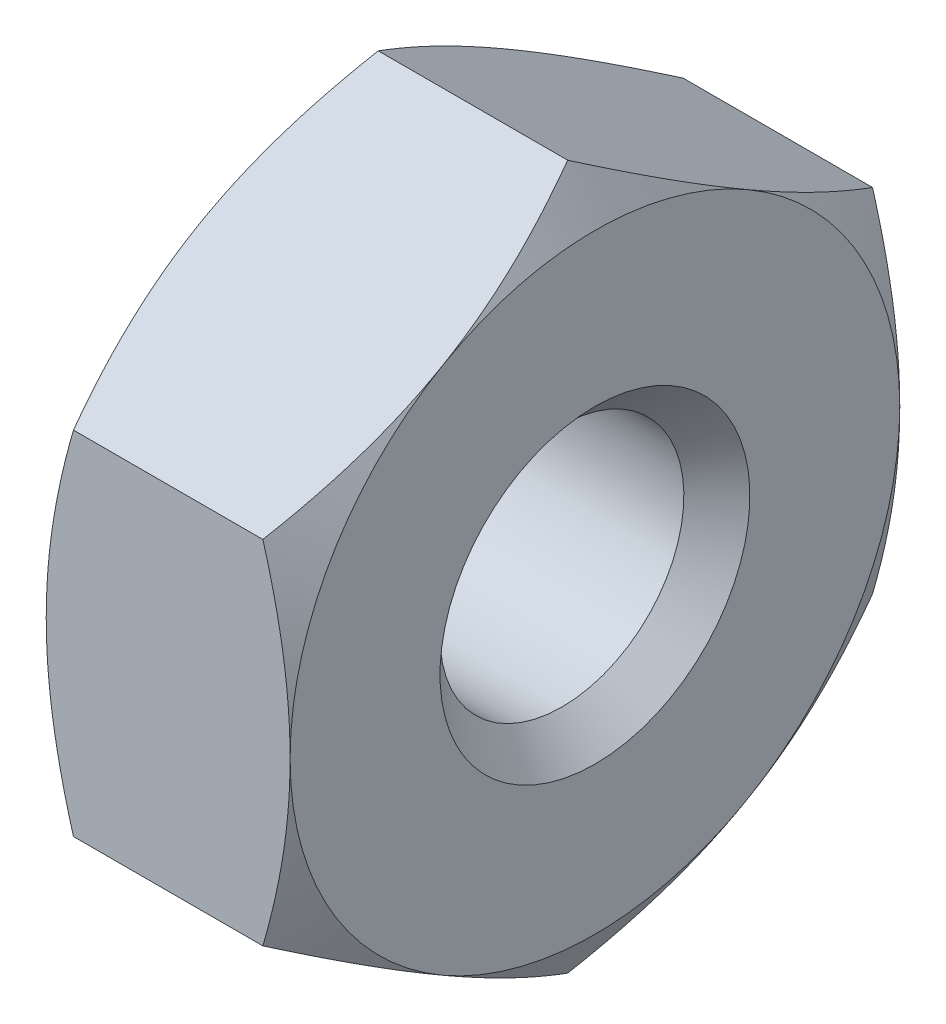
ISO-10303-21;
HEADER;
FILE_DESCRIPTION(('STEP AP214'),'2;1');
FILE_NAME('part.step','',(''),(''),'','','');
FILE_SCHEMA(('AUTOMOTIVE_DESIGN { 1 0 10303 214 1 1 1 1 }'));
ENDSEC;
DATA;
#1=APPLICATION_CONTEXT('core data for automotive mechanical design processes');
#2=APPLICATION_PROTOCOL_DEFINITION('international standard','automotive_design',2000,#1);
#3=PRODUCT_CONTEXT('',#1,'mechanical');
#4=PRODUCT('Part','Part','',(#3));
#5=PRODUCT_RELATED_PRODUCT_CATEGORY('part','',(#4));
#6=PRODUCT_DEFINITION_FORMATION('','',#4);
#7=PRODUCT_DEFINITION_CONTEXT('part definition',#1,'design');
#8=PRODUCT_DEFINITION('design','',#6,#7);
#9=PRODUCT_DEFINITION_SHAPE('','',#8);
#10=(LENGTH_UNIT() NAMED_UNIT(*) SI_UNIT(.MILLI.,.METRE.));
#11=(NAMED_UNIT(*) PLANE_ANGLE_UNIT() SI_UNIT($,.RADIAN.));
#12=(NAMED_UNIT(*) SI_UNIT($,.STERADIAN.) SOLID_ANGLE_UNIT());
#13=UNCERTAINTY_MEASURE_WITH_UNIT(LENGTH_MEASURE(1.E-05),#10,'distance_accuracy_value','');
#14=(GEOMETRIC_REPRESENTATION_CONTEXT(3) GLOBAL_UNCERTAINTY_ASSIGNED_CONTEXT((#13)) GLOBAL_UNIT_ASSIGNED_CONTEXT((#10,
#11,#12)) REPRESENTATION_CONTEXT('',''));
#15=CARTESIAN_POINT('',(0.,0.,0.));
#16=DIRECTION('',(0.,0.,1.));
#17=DIRECTION('',(1.,0.,0.));
#18=AXIS2_PLACEMENT_3D('',#15,#16,#17);
#19=CARTESIAN_POINT('',(0.,0.,0.));
#20=DIRECTION('',(1.,0.,0.));
#21=DIRECTION('',(0.,0.,-1.));
#22=AXIS2_PLACEMENT_3D('',#19,#20,#21);
#23=PLANE('',#22);
#24=CARTESIAN_POINT('',(0.,0.,0.));
#25=DIRECTION('',(-1.,0.,0.));
#26=DIRECTION('',(0.,0.,1.));
#27=AXIS2_PLACEMENT_3D('',#24,#25,#26);
#28=CIRCLE('',#27,2.);
#29=CARTESIAN_POINT('',(0.,0.,2.));
#30=VERTEX_POINT('',#29);
#31=CARTESIAN_POINT('',(0.,1.73205080756891,0.999999999999976));
#32=VERTEX_POINT('',#31);
#33=EDGE_CURVE('E11',#30,#32,#28,.T.);
#34=ORIENTED_EDGE('',*,*,#33,.T.);
#35=CARTESIAN_POINT('',(0.,1.73205080756891,-0.999999999999977));
#36=VERTEX_POINT('',#35);
#37=EDGE_CURVE('E42',#32,#36,#28,.T.);
#38=ORIENTED_EDGE('',*,*,#37,.T.);
#39=CARTESIAN_POINT('',(0.,0.,-2.));
#40=VERTEX_POINT('',#39);
#41=EDGE_CURVE('E142',#36,#40,#28,.T.);
#42=ORIENTED_EDGE('',*,*,#41,.T.);
#43=CARTESIAN_POINT('',(0.,-1.73205080756891,-0.999999999999976));
#44=VERTEX_POINT('',#43);
#45=EDGE_CURVE('E154',#40,#44,#28,.T.);
#46=ORIENTED_EDGE('',*,*,#45,.T.);
#47=CARTESIAN_POINT('',(0.,-1.73205080756891,0.999999999999977));
#48=VERTEX_POINT('',#47);
#49=EDGE_CURVE('E149',#44,#48,#28,.T.);
#50=ORIENTED_EDGE('',*,*,#49,.T.);
#51=EDGE_CURVE('E43',#48,#30,#28,.T.);
#52=ORIENTED_EDGE('',*,*,#51,.T.);
#53=EDGE_LOOP('',(#34,#38,#42,#46,#50,#52));
#54=FACE_BOUND('',#53,.T.);
#55=CARTESIAN_POINT('',(0.,-0.0165000000000002,0.));
#56=DIRECTION('',(-1.,0.,0.));
#57=DIRECTION('',(0.,-1.,0.));
#58=AXIS2_PLACEMENT_3D('',#55,#56,#57);
#59=CIRCLE('',#58,1.0165);
#60=CARTESIAN_POINT('',(0.,-1.033,0.));
#61=VERTEX_POINT('',#60);
#62=EDGE_CURVE('E476',#61,#61,#59,.T.);
#63=ORIENTED_EDGE('',*,*,#62,.F.);
#64=EDGE_LOOP('',(#63));
#65=FACE_BOUND('',#64,.T.);
#66=ADVANCED_FACE('F35',(#54,#65),#23,.F.);
#67=CARTESIAN_POINT('',(1.6,2.,0.));
#68=DIRECTION('',(-1.,0.,0.));
#69=DIRECTION('',(0.,0.,1.));
#70=AXIS2_PLACEMENT_3D('',#67,#68,#69);
#71=PLANE('',#70);
#72=CARTESIAN_POINT('',(1.6,0.,0.));
#73=DIRECTION('',(-1.,0.,0.));
#74=DIRECTION('',(0.,0.,1.));
#75=AXIS2_PLACEMENT_3D('',#72,#73,#74);
#76=CIRCLE('',#75,2.);
#77=CARTESIAN_POINT('',(1.6,0.,2.));
#78=VERTEX_POINT('',#77);
#79=CARTESIAN_POINT('',(1.6,1.73205080756891,0.999999999999976));
#80=VERTEX_POINT('',#79);
#81=EDGE_CURVE('E153',#78,#80,#76,.T.);
#82=ORIENTED_EDGE('',*,*,#81,.F.);
#83=CARTESIAN_POINT('',(1.6,-1.73205080756891,0.999999999999977));
#84=VERTEX_POINT('',#83);
#85=EDGE_CURVE('E157',#84,#78,#76,.T.);
#86=ORIENTED_EDGE('',*,*,#85,.F.);
#87=CARTESIAN_POINT('',(1.6,-1.73205080756891,-0.999999999999976));
#88=VERTEX_POINT('',#87);
#89=EDGE_CURVE('E166',#88,#84,#76,.T.);
#90=ORIENTED_EDGE('',*,*,#89,.F.);
#91=CARTESIAN_POINT('',(1.6,0.,-2.));
#92=VERTEX_POINT('',#91);
#93=EDGE_CURVE('E173',#92,#88,#76,.T.);
#94=ORIENTED_EDGE('',*,*,#93,.F.);
#95=CARTESIAN_POINT('',(1.6,1.73205080756891,-0.999999999999977));
#96=VERTEX_POINT('',#95);
#97=EDGE_CURVE('E163',#96,#92,#76,.T.);
#98=ORIENTED_EDGE('',*,*,#97,.F.);
#99=EDGE_CURVE('E156',#80,#96,#76,.T.);
#100=ORIENTED_EDGE('',*,*,#99,.F.);
#101=EDGE_LOOP('',(#82,#86,#90,#94,#98,#100));
#102=FACE_BOUND('',#101,.T.);
#103=CARTESIAN_POINT('',(1.6,-0.0165,0.));
#104=DIRECTION('',(-1.,0.,0.));
#105=DIRECTION('',(0.,-1.,0.));
#106=AXIS2_PLACEMENT_3D('',#103,#104,#105);
#107=CIRCLE('',#106,1.0165);
#108=CARTESIAN_POINT('',(1.6,-1.033,0.));
#109=VERTEX_POINT('',#108);
#110=EDGE_CURVE('E469',#109,#109,#107,.T.);
#111=ORIENTED_EDGE('',*,*,#110,.T.);
#112=EDGE_LOOP('',(#111));
#113=FACE_BOUND('',#112,.T.);
#114=ADVANCED_FACE('F196',(#102,#113),#71,.F.);
#115=CARTESIAN_POINT('',(0.23094010767585,0.,0.));
#116=DIRECTION('',(1.,0.,0.));
#117=DIRECTION('',(0.,0.,-1.));
#118=AXIS2_PLACEMENT_3D('',#115,#116,#117);
#119=CONICAL_SURFACE('',#118,2.4,1.0471975511966);
#120=CARTESIAN_POINT('',(0.960564620719933,-3.06969706647036,-2.));
#121=CARTESIAN_POINT('',(0.918447719225208,-2.9826070276099,-2.));
#122=CARTESIAN_POINT('',(0.876744016162863,-2.89531359514955,-2.));
#123=CARTESIAN_POINT('',(0.794396068040801,-2.7202116534341,-2.));
#124=CARTESIAN_POINT('',(0.753751996572019,-2.63240306263545,-2.));
#125=CARTESIAN_POINT('',(0.673544990993442,-2.45569454632309,-2.));
#126=CARTESIAN_POINT('',(0.633989435943704,-2.36679125959124,-2.));
#127=CARTESIAN_POINT('',(0.556540402154615,-2.18826628410374,-2.));
#128=CARTESIAN_POINT('',(0.518646842634758,-2.09864463051497,-2.));
#129=CARTESIAN_POINT('',(0.443829653550125,-1.91577344840977,-2.));
#130=CARTESIAN_POINT('',(0.406971478102181,-1.82249699059152,-2.));
#131=CARTESIAN_POINT('',(0.336122939262721,-1.6348410353351,-2.));
#132=CARTESIAN_POINT('',(0.302132902146455,-1.54046141378927,-2.));
#133=CARTESIAN_POINT('',(0.23793647872302,-1.35063624877528,-2.));
#134=CARTESIAN_POINT('',(0.207722147203833,-1.25519342016057,-2.));
#135=CARTESIAN_POINT('',(0.152067637871518,-1.06293935737291,-2.));
#136=CARTESIAN_POINT('',(0.126625921949113,-0.966128574914755,-2.));
#137=CARTESIAN_POINT('',(0.0818921981020604,-0.771614672106065,-2.));
#138=CARTESIAN_POINT('',(0.0625680611245456,-0.673919082405869,-2.));
#139=CARTESIAN_POINT('',(0.0311826829037339,-0.477348057700207,-2.));
#140=CARTESIAN_POINT('',(0.019120817656442,-0.378472724807819,-2.));
#141=CARTESIAN_POINT('',(0.00338395694954182,-0.181309994953057,-2.));
#142=CARTESIAN_POINT('',(-0.000396305644867935,-0.0830312460429947,-2.));
#143=CARTESIAN_POINT('',(0.000463238435134451,0.113485509919442,-2.));
#144=CARTESIAN_POINT('',(0.0051032754562111,0.211723515783711,-2.));
#145=CARTESIAN_POINT('',(0.0261043536527811,0.449358015625644,-2.));
#146=CARTESIAN_POINT('',(0.0466295476569,0.588388308666181,-2.));
#147=CARTESIAN_POINT('',(0.100865803906909,0.863858384666713,-2.));
#148=CARTESIAN_POINT('',(0.134590227817296,1.00029539521143,-2.));
#149=CARTESIAN_POINT('',(0.212402210305629,1.2733111237595,-2.));
#150=CARTESIAN_POINT('',(0.256698760305387,1.40982867525533,-2.));
#151=CARTESIAN_POINT('',(0.35218269853151,1.68033618831129,-2.));
#152=CARTESIAN_POINT('',(0.403368017200074,1.81432689526771,-2.));
#153=CARTESIAN_POINT('',(0.525435422837317,2.117419520614,-2.));
#154=CARTESIAN_POINT('',(0.59783250306695,2.28590501198163,-2.));
#155=CARTESIAN_POINT('',(0.747637620106175,2.62064677617018,-2.));
#156=CARTESIAN_POINT('',(0.825046777956453,2.78690254016494,-2.));
#157=CARTESIAN_POINT('',(0.983289343459741,3.11794960660753,-2.));
#158=CARTESIAN_POINT('',(1.06412572953733,3.28273947819276,-2.));
#159=CARTESIAN_POINT('',(1.22813169774068,3.61115513686861,-2.));
#160=CARTESIAN_POINT('',(1.31130135119586,3.77478088817925,-2.));
#161=CARTESIAN_POINT('',(1.47277008597423,4.0884514085166,-2.));
#162=CARTESIAN_POINT('',(1.55094370088272,4.23856092803469,-2.));
#163=CARTESIAN_POINT('',(1.70837218486806,4.53821671672572,-2.));
#164=CARTESIAN_POINT('',(1.78762708542198,4.68776296933911,-2.));
#165=CARTESIAN_POINT('',(1.94679238177092,4.98608322935775,-2.));
#166=CARTESIAN_POINT('',(2.02670095253288,5.13485821182457,-2.));
#167=CARTESIAN_POINT('',(2.18717495383285,5.43204425779157,-2.));
#168=CARTESIAN_POINT('',(2.26774035205521,5.5804553387338,-2.));
#169=CARTESIAN_POINT('',(2.3485529800385,5.72873071831092,-2.));
#170=B_SPLINE_CURVE_WITH_KNOTS('',3,(#120,#121,#122,#123,#124,#125,#126,#127,#128,#129,#130,
#131,#132,#133,#134,#135,#136,#137,#138,#139,#140,#141,#142,#143,#144,#145,#146,#147,#148,#149,
#150,#151,#152,#153,#154,#155,#156,#157,#158,#159,#160,#161,#162,#163,#164,#165,#166,#167,#168,
#169),.UNSPECIFIED.,.F.,.F.,(4,2,2,2,2,2,2,2,2,2,2,2,2,2,2,2,2,2,2,2,2,2,2,2,4),(0.,
0.290221855965844,0.580490961635766,0.872395030380332,1.16428489550747,1.46513250000125,
1.76601428247193,2.06625185869287,2.36639250807088,2.66492963544421,2.96344110762832,
3.25813564536262,3.55283824491541,3.97358015663303,4.39474909430442,4.82505701428419,
5.25523594641708,5.80524450910989,6.35537651886984,6.90599683350142,7.45663399931517,
7.96436452021779,8.47210985322803,8.97873847527003,9.48534232003251),.UNSPECIFIED.);
#171=CARTESIAN_POINT('',(0.178632794954096,-1.1547005383793,-2.));
#172=VERTEX_POINT('',#171);
#173=EDGE_CURVE('E278',#40,#172,#170,.F.);
#174=ORIENTED_EDGE('',*,*,#173,.T.);
#175=CARTESIAN_POINT('',(0.178699466620512,-1.15458506832546,-2.0002));
#176=CARTESIAN_POINT('',(0.149389536100693,-1.20532911262023,-1.91230873709994));
#177=CARTESIAN_POINT('',(0.12273285198048,-1.25651117447785,-1.82365880552641));
#178=CARTESIAN_POINT('',(0.0762024910207341,-1.35976164019324,-1.64482375300219));
#179=CARTESIAN_POINT('',(0.0563452763827919,-1.41183187919149,-1.55463545349495));
#180=CARTESIAN_POINT('',(0.0254334640232647,-1.51532701829187,-1.37537661423668));
#181=CARTESIAN_POINT('',(0.0141731515985431,-1.56673599086582,-1.28633366177368));
#182=CARTESIAN_POINT('',(0.000728662594653389,-1.66979593505377,-1.10782860221494));
#183=CARTESIAN_POINT('',(-0.00146664504652047,-1.72144653186535,-1.01836714429602));
#184=CARTESIAN_POINT('',(0.00309098933066007,-1.81796535054797,-0.851191646451181));
#185=CARTESIAN_POINT('',(0.0087248746870256,-1.86284799277606,-0.773452629734197));
#186=CARTESIAN_POINT('',(0.0265838952608381,-1.95232085557727,-0.618481085463851));
#187=CARTESIAN_POINT('',(0.0388151360234481,-1.99691076648956,-0.541249094258788));
#188=CARTESIAN_POINT('',(0.0693934368676162,-2.08656822922817,-0.38595781351779));
#189=CARTESIAN_POINT('',(0.0878701670657209,-2.13162442866768,-0.307918186892613));
#190=CARTESIAN_POINT('',(0.129805518212858,-2.221064675979,-0.153003134307861));
#191=CARTESIAN_POINT('',(0.153254280492314,-2.26544987045196,-0.076125722376878));
#192=CARTESIAN_POINT('',(0.178699466620497,-2.30951654681234,0.000199999999999941));
#193=B_SPLINE_CURVE_WITH_KNOTS('',3,(#175,#176,#177,#178,#179,#180,#181,#182,#183,#184,#185,
#186,#187,#188,#189,#190,#191,#192),.UNSPECIFIED.,.F.,.F.,(4,2,2,2,2,2,2,2,4),(0.,
0.317031824695613,0.63482587634657,0.944753967652646,1.25430138000373,1.52387047293094,
1.79368946861028,2.06949491027632,2.3447585082147),.UNSPECIFIED.);
#194=EDGE_CURVE('E245',#172,#44,#193,.T.);
#195=ORIENTED_EDGE('',*,*,#194,.T.);
#196=ORIENTED_EDGE('',*,*,#45,.F.);
#197=EDGE_LOOP('',(#174,#195,#196));
#198=FACE_BOUND('',#197,.T.);
#199=ADVANCED_FACE('F199',(#198),#119,.T.);
#200=ORIENTED_EDGE('',*,*,#49,.F.);
#201=CARTESIAN_POINT('',(0.17863279495408,-2.3094010767585,0.));
#202=VERTEX_POINT('',#201);
#203=EDGE_CURVE('E246',#44,#202,#193,.T.);
#204=ORIENTED_EDGE('',*,*,#203,.T.);
#205=CARTESIAN_POINT('',(0.178699466620497,-2.30951654681234,-0.0002));
#206=CARTESIAN_POINT('',(0.149389536100679,-2.25877250251757,0.0876912629000611));
#207=CARTESIAN_POINT('',(0.122732851980468,-2.20759044065996,0.176341194473594));
#208=CARTESIAN_POINT('',(0.0762024910207237,-2.10433997494457,0.355176246997806));
#209=CARTESIAN_POINT('',(0.0563452763827828,-2.05226973594631,0.445364546505042));
#210=CARTESIAN_POINT('',(0.0254334640232587,-1.94877459684593,0.624623385763314));
#211=CARTESIAN_POINT('',(0.0141731515985388,-1.89736562427198,0.713666338226313));
#212=CARTESIAN_POINT('',(0.000728662594652176,-1.79430568008404,0.892171397785054));
#213=CARTESIAN_POINT('',(-0.00146664504652041,-1.74265508327246,0.98163285570397));
#214=CARTESIAN_POINT('',(0.00309098933066239,-1.64613626458983,1.14880835354881));
#215=CARTESIAN_POINT('',(0.00872487468702908,-1.60125362236175,1.22654737026579));
#216=CARTESIAN_POINT('',(0.026583895260844,-1.51178075956053,1.38151891453614));
#217=CARTESIAN_POINT('',(0.0388151360234552,-1.46719084864824,1.45875090574121));
#218=CARTESIAN_POINT('',(0.0693934368676259,-1.37753338590963,1.61404218648221));
#219=CARTESIAN_POINT('',(0.087870167065732,-1.33247718647013,1.69208181310738));
#220=CARTESIAN_POINT('',(0.129805518212872,-1.2430369391588,1.84699686569214));
#221=CARTESIAN_POINT('',(0.153254280492329,-1.19865174468584,1.92387427762312));
#222=CARTESIAN_POINT('',(0.178699466620512,-1.15458506832546,2.0002));
#223=B_SPLINE_CURVE_WITH_KNOTS('',3,(#205,#206,#207,#208,#209,#210,#211,#212,#213,#214,#215,
#216,#217,#218,#219,#220,#221,#222),.UNSPECIFIED.,.F.,.F.,(4,2,2,2,2,2,2,2,4),(0.,
0.31703182469561,0.634825876346563,0.944753967652636,1.25430138000371,1.52387047293093,
1.79368946861027,2.06949491027632,2.3447585082147),.UNSPECIFIED.);
#224=EDGE_CURVE('E254',#202,#48,#223,.T.);
#225=ORIENTED_EDGE('',*,*,#224,.T.);
#226=EDGE_LOOP('',(#200,#204,#225));
#227=FACE_BOUND('',#226,.T.);
#228=ADVANCED_FACE('F317',(#227),#119,.T.);
#229=ORIENTED_EDGE('',*,*,#51,.F.);
#230=CARTESIAN_POINT('',(0.178632794954096,-1.1547005383793,2.));
#231=VERTEX_POINT('',#230);
#232=EDGE_CURVE('E250',#48,#231,#223,.T.);
#233=ORIENTED_EDGE('',*,*,#232,.T.);
#234=CARTESIAN_POINT('',(0.960564620719933,-3.06969706647036,2.));
#235=CARTESIAN_POINT('',(0.918447719225208,-2.9826070276099,2.));
#236=CARTESIAN_POINT('',(0.876744016162863,-2.89531359514955,2.));
#237=CARTESIAN_POINT('',(0.794396068040801,-2.7202116534341,2.));
#238=CARTESIAN_POINT('',(0.753751996572019,-2.63240306263545,2.));
#239=CARTESIAN_POINT('',(0.673544990993442,-2.45569454632309,2.));
#240=CARTESIAN_POINT('',(0.633989435943704,-2.36679125959124,2.));
#241=CARTESIAN_POINT('',(0.556540402154615,-2.18826628410374,2.));
#242=CARTESIAN_POINT('',(0.518646842634758,-2.09864463051497,2.));
#243=CARTESIAN_POINT('',(0.443829653550125,-1.91577344840977,2.));
#244=CARTESIAN_POINT('',(0.406971478102181,-1.82249699059152,2.));
#245=CARTESIAN_POINT('',(0.336122939262721,-1.6348410353351,2.));
#246=CARTESIAN_POINT('',(0.302132902146455,-1.54046141378927,2.));
#247=CARTESIAN_POINT('',(0.23793647872302,-1.35063624877528,2.));
#248=CARTESIAN_POINT('',(0.207722147203833,-1.25519342016057,2.));
#249=CARTESIAN_POINT('',(0.152067637871518,-1.06293935737291,2.));
#250=CARTESIAN_POINT('',(0.126625921949113,-0.966128574914755,2.));
#251=CARTESIAN_POINT('',(0.0818921981020604,-0.771614672106065,2.));
#252=CARTESIAN_POINT('',(0.0625680611245456,-0.673919082405869,2.));
#253=CARTESIAN_POINT('',(0.0311826829037339,-0.477348057700207,2.));
#254=CARTESIAN_POINT('',(0.019120817656442,-0.378472724807819,2.));
#255=CARTESIAN_POINT('',(0.00338395694954182,-0.181309994953057,2.));
#256=CARTESIAN_POINT('',(-0.000396305644867935,-0.0830312460429947,2.));
#257=CARTESIAN_POINT('',(0.000463238435134451,0.113485509919442,2.));
#258=CARTESIAN_POINT('',(0.0051032754562111,0.211723515783711,2.));
#259=CARTESIAN_POINT('',(0.0261043536527811,0.449358015625644,2.));
#260=CARTESIAN_POINT('',(0.0466295476569,0.588388308666181,2.));
#261=CARTESIAN_POINT('',(0.100865803906909,0.863858384666713,2.));
#262=CARTESIAN_POINT('',(0.134590227817296,1.00029539521143,2.));
#263=CARTESIAN_POINT('',(0.212402210305629,1.2733111237595,2.));
#264=CARTESIAN_POINT('',(0.256698760305387,1.40982867525533,2.));
#265=CARTESIAN_POINT('',(0.35218269853151,1.68033618831129,2.));
#266=CARTESIAN_POINT('',(0.403368017200074,1.81432689526771,2.));
#267=CARTESIAN_POINT('',(0.525435422837317,2.117419520614,2.));
#268=CARTESIAN_POINT('',(0.59783250306695,2.28590501198163,2.));
#269=CARTESIAN_POINT('',(0.747637620106175,2.62064677617018,2.));
#270=CARTESIAN_POINT('',(0.825046777956453,2.78690254016494,2.));
#271=CARTESIAN_POINT('',(0.983289343459741,3.11794960660753,2.));
#272=CARTESIAN_POINT('',(1.06412572953733,3.28273947819276,2.));
#273=CARTESIAN_POINT('',(1.22813169774068,3.61115513686861,2.));
#274=CARTESIAN_POINT('',(1.31130135119586,3.77478088817925,2.));
#275=CARTESIAN_POINT('',(1.47277008597423,4.0884514085166,2.));
#276=CARTESIAN_POINT('',(1.55094370088272,4.23856092803469,2.));
#277=CARTESIAN_POINT('',(1.70837218486806,4.53821671672572,2.));
#278=CARTESIAN_POINT('',(1.78762708542198,4.68776296933911,2.));
#279=CARTESIAN_POINT('',(1.94679238177092,4.98608322935775,2.));
#280=CARTESIAN_POINT('',(2.02670095253288,5.13485821182457,2.));
#281=CARTESIAN_POINT('',(2.18717495383285,5.43204425779157,2.));
#282=CARTESIAN_POINT('',(2.26774035205521,5.5804553387338,2.));
#283=CARTESIAN_POINT('',(2.3485529800385,5.72873071831092,2.));
#284=B_SPLINE_CURVE_WITH_KNOTS('',3,(#234,#235,#236,#237,#238,#239,#240,#241,#242,#243,#244,
#245,#246,#247,#248,#249,#250,#251,#252,#253,#254,#255,#256,#257,#258,#259,#260,#261,#262,#263,
#264,#265,#266,#267,#268,#269,#270,#271,#272,#273,#274,#275,#276,#277,#278,#279,#280,#281,#282,
#283),.UNSPECIFIED.,.F.,.F.,(4,2,2,2,2,2,2,2,2,2,2,2,2,2,2,2,2,2,2,2,2,2,2,2,4),(0.,
0.290221855965844,0.580490961635766,0.872395030380332,1.16428489550747,1.46513250000125,
1.76601428247193,2.06625185869287,2.36639250807088,2.66492963544421,2.96344110762832,
3.25813564536262,3.55283824491541,3.97358015663303,4.39474909430442,4.82505701428419,
5.25523594641708,5.80524450910989,6.35537651886984,6.90599683350142,7.45663399931517,
7.96436452021779,8.47210985322803,8.97873847527003,9.48534232003251),.UNSPECIFIED.);
#285=EDGE_CURVE('E167',#231,#30,#284,.T.);
#286=ORIENTED_EDGE('',*,*,#285,.T.);
#287=EDGE_LOOP('',(#229,#233,#286));
#288=FACE_BOUND('',#287,.T.);
#289=ADVANCED_FACE('F324',(#288),#119,.T.);
#290=CARTESIAN_POINT('',(0.178699466620497,2.30951654681234,0.0002));
#291=CARTESIAN_POINT('',(0.149389536100679,2.25877250251757,-0.0876912629000611));
#292=CARTESIAN_POINT('',(0.122732851980468,2.20759044065996,-0.176341194473594));
#293=CARTESIAN_POINT('',(0.0762024910207237,2.10433997494457,-0.355176246997806));
#294=CARTESIAN_POINT('',(0.0563452763827828,2.05226973594631,-0.445364546505042));
#295=CARTESIAN_POINT('',(0.0254334640232587,1.94877459684593,-0.624623385763314));
#296=CARTESIAN_POINT('',(0.0141731515985388,1.89736562427198,-0.713666338226313));
#297=CARTESIAN_POINT('',(0.000728662594652176,1.79430568008404,-0.892171397785054));
#298=CARTESIAN_POINT('',(-0.00146664504652041,1.74265508327246,-0.98163285570397));
#299=CARTESIAN_POINT('',(0.00309098933066239,1.64613626458983,-1.14880835354881));
#300=CARTESIAN_POINT('',(0.00872487468702908,1.60125362236175,-1.22654737026579));
#301=CARTESIAN_POINT('',(0.026583895260844,1.51178075956053,-1.38151891453614));
#302=CARTESIAN_POINT('',(0.0388151360234552,1.46719084864824,-1.45875090574121));
#303=CARTESIAN_POINT('',(0.0693934368676259,1.37753338590963,-1.61404218648221));
#304=CARTESIAN_POINT('',(0.087870167065732,1.33247718647013,-1.69208181310738));
#305=CARTESIAN_POINT('',(0.129805518212872,1.2430369391588,-1.84699686569214));
#306=CARTESIAN_POINT('',(0.153254280492329,1.19865174468584,-1.92387427762312));
#307=CARTESIAN_POINT('',(0.178699466620512,1.15458506832546,-2.0002));
#308=B_SPLINE_CURVE_WITH_KNOTS('',3,(#290,#291,#292,#293,#294,#295,#296,#297,#298,#299,#300,
#301,#302,#303,#304,#305,#306,#307),.UNSPECIFIED.,.F.,.F.,(4,2,2,2,2,2,2,2,4),(0.,
0.31703182469561,0.634825876346563,0.944753967652636,1.25430138000371,1.52387047293093,
1.79368946861027,2.06949491027632,2.3447585082147),.UNSPECIFIED.);
#309=CARTESIAN_POINT('',(0.178632794954096,1.1547005383793,-2.));
#310=VERTEX_POINT('',#309);
#311=EDGE_CURVE('E495',#36,#310,#308,.T.);
#312=ORIENTED_EDGE('',*,*,#311,.T.);
#313=EDGE_CURVE('E274',#310,#40,#170,.F.);
#314=ORIENTED_EDGE('',*,*,#313,.T.);
#315=ORIENTED_EDGE('',*,*,#41,.F.);
#316=EDGE_LOOP('',(#312,#314,#315));
#317=FACE_BOUND('',#316,.T.);
#318=ADVANCED_FACE('F331',(#317),#119,.T.);
#319=ORIENTED_EDGE('',*,*,#33,.F.);
#320=CARTESIAN_POINT('',(0.178632794954096,1.1547005383793,2.));
#321=VERTEX_POINT('',#320);
#322=EDGE_CURVE('E134',#30,#321,#284,.T.);
#323=ORIENTED_EDGE('',*,*,#322,.T.);
#324=CARTESIAN_POINT('',(0.178699466620512,1.15458506832546,2.0002));
#325=CARTESIAN_POINT('',(0.149389536100693,1.20532911262023,1.91230873709994));
#326=CARTESIAN_POINT('',(0.12273285198048,1.25651117447785,1.82365880552641));
#327=CARTESIAN_POINT('',(0.0762024910207341,1.35976164019324,1.64482375300219));
#328=CARTESIAN_POINT('',(0.0563452763827919,1.41183187919149,1.55463545349495));
#329=CARTESIAN_POINT('',(0.0254334640232647,1.51532701829187,1.37537661423668));
#330=CARTESIAN_POINT('',(0.0141731515985431,1.56673599086582,1.28633366177368));
#331=CARTESIAN_POINT('',(0.000728662594653389,1.66979593505377,1.10782860221494));
#332=CARTESIAN_POINT('',(-0.00146664504652047,1.72144653186535,1.01836714429602));
#333=CARTESIAN_POINT('',(0.00309098933066007,1.81796535054797,0.851191646451181));
#334=CARTESIAN_POINT('',(0.0087248746870256,1.86284799277606,0.773452629734197));
#335=CARTESIAN_POINT('',(0.0265838952608381,1.95232085557727,0.618481085463851));
#336=CARTESIAN_POINT('',(0.0388151360234481,1.99691076648956,0.541249094258788));
#337=CARTESIAN_POINT('',(0.0693934368676162,2.08656822922817,0.38595781351779));
#338=CARTESIAN_POINT('',(0.0878701670657209,2.13162442866768,0.307918186892613));
#339=CARTESIAN_POINT('',(0.129805518212858,2.221064675979,0.153003134307861));
#340=CARTESIAN_POINT('',(0.153254280492314,2.26544987045196,0.076125722376878));
#341=CARTESIAN_POINT('',(0.178699466620497,2.30951654681234,-0.000199999999999941));
#342=B_SPLINE_CURVE_WITH_KNOTS('',3,(#324,#325,#326,#327,#328,#329,#330,#331,#332,#333,#334,
#335,#336,#337,#338,#339,#340,#341),.UNSPECIFIED.,.F.,.F.,(4,2,2,2,2,2,2,2,4),(0.,
0.317031824695613,0.63482587634657,0.944753967652646,1.25430138000373,1.52387047293094,
1.79368946861028,2.06949491027632,2.3447585082147),.UNSPECIFIED.);
#343=EDGE_CURVE('E124',#321,#32,#342,.T.);
#344=ORIENTED_EDGE('',*,*,#343,.T.);
#345=EDGE_LOOP('',(#319,#323,#344));
#346=FACE_BOUND('',#345,.T.);
#347=ADVANCED_FACE('F133',(#346),#119,.T.);
#348=CARTESIAN_POINT('',(0.17863279495408,2.3094010767585,0.));
#349=VERTEX_POINT('',#348);
#350=EDGE_CURVE('E121',#32,#349,#342,.T.);
#351=ORIENTED_EDGE('',*,*,#350,.T.);
#352=EDGE_CURVE('E138',#349,#36,#308,.T.);
#353=ORIENTED_EDGE('',*,*,#352,.T.);
#354=ORIENTED_EDGE('',*,*,#37,.F.);
#355=EDGE_LOOP('',(#351,#353,#354));
#356=FACE_BOUND('',#355,.T.);
#357=ADVANCED_FACE('F137',(#356),#119,.T.);
#358=CARTESIAN_POINT('',(1.6,1.1547005383793,2.));
#359=DIRECTION('',(0.,0.,-1.));
#360=DIRECTION('',(-1.,0.,0.));
#361=AXIS2_PLACEMENT_3D('',#358,#359,#360);
#362=PLANE('',#361);
#363=DIRECTION('',(-1.,0.,0.));
#364=VECTOR('',#363,1.);
#365=CARTESIAN_POINT('',(1.6,-1.1547005383793,2.));
#366=LINE('',#365,#364);
#367=CARTESIAN_POINT('',(1.42136720504594,-1.1547005383793,2.));
#368=VERTEX_POINT('',#367);
#369=EDGE_CURVE('E488',#368,#231,#366,.T.);
#370=ORIENTED_EDGE('',*,*,#369,.F.);
#371=CARTESIAN_POINT('',(0.639435379280275,-3.06969706647035,2.));
#372=CARTESIAN_POINT('',(0.681552280774991,-2.9826070276099,2.));
#373=CARTESIAN_POINT('',(0.723255983837329,-2.89531359514955,2.));
#374=CARTESIAN_POINT('',(0.805603931959375,-2.7202116534341,2.));
#375=CARTESIAN_POINT('',(0.846248003428148,-2.63240306263544,2.));
#376=CARTESIAN_POINT('',(0.926455009006709,-2.45569454632308,2.));
#377=CARTESIAN_POINT('',(0.966010564056439,-2.36679125959122,2.));
#378=CARTESIAN_POINT('',(1.04345959784551,-2.18826628410372,2.));
#379=CARTESIAN_POINT('',(1.08135315736536,-2.09864463051495,2.));
#380=CARTESIAN_POINT('',(1.15617034644998,-1.91577344840975,2.));
#381=CARTESIAN_POINT('',(1.19302852189791,-1.82249699059151,2.));
#382=CARTESIAN_POINT('',(1.26387706073736,-1.63484103533508,2.));
#383=CARTESIAN_POINT('',(1.29786709785361,-1.54046141378926,2.));
#384=CARTESIAN_POINT('',(1.36206352127704,-1.35063624877527,2.));
#385=CARTESIAN_POINT('',(1.39227785279622,-1.25519342016056,2.));
#386=CARTESIAN_POINT('',(1.44793236212852,-1.0629393573729,2.));
#387=CARTESIAN_POINT('',(1.47337407805092,-0.966128574914751,2.));
#388=CARTESIAN_POINT('',(1.51810780189796,-0.771614672106066,2.));
#389=CARTESIAN_POINT('',(1.53743193887547,-0.673919082405873,2.));
#390=CARTESIAN_POINT('',(1.56881731709627,-0.477348057700216,2.));
#391=CARTESIAN_POINT('',(1.58087918234356,-0.378472724807832,2.));
#392=CARTESIAN_POINT('',(1.59661604305046,-0.181309994953076,2.));
#393=CARTESIAN_POINT('',(1.60039630564487,-0.0830312460430169,2.));
#394=CARTESIAN_POINT('',(1.59953676156487,0.113485509919414,2.));
#395=CARTESIAN_POINT('',(1.59489672454379,0.21172351578368,2.));
#396=CARTESIAN_POINT('',(1.57389564634723,0.449358015625645,2.));
#397=CARTESIAN_POINT('',(1.55337045234311,0.588388308666217,2.));
#398=CARTESIAN_POINT('',(1.49913419609309,0.863858384666819,2.));
#399=CARTESIAN_POINT('',(1.4654097721827,1.00029539521157,2.));
#400=CARTESIAN_POINT('',(1.38759778969435,1.27331112375971,2.));
#401=CARTESIAN_POINT('',(1.34330123969459,1.40982867525558,2.));
#402=CARTESIAN_POINT('',(1.24781730146845,1.6803361883116,2.));
#403=CARTESIAN_POINT('',(1.19663198279988,1.81432689526806,2.));
#404=CARTESIAN_POINT('',(1.07456457716264,2.11741952061438,2.));
#405=CARTESIAN_POINT('',(1.00216749693301,2.28590501198201,2.));
#406=CARTESIAN_POINT('',(0.852362379893811,2.62064677617057,2.));
#407=CARTESIAN_POINT('',(0.774953222043546,2.78690254016532,2.));
#408=CARTESIAN_POINT('',(0.616710656540284,3.11794960660791,2.));
#409=CARTESIAN_POINT('',(0.535874270462706,3.28273947819314,2.));
#410=CARTESIAN_POINT('',(0.371868302259383,3.611155136869,2.));
#411=CARTESIAN_POINT('',(0.288698648804225,3.77478088817965,2.));
#412=CARTESIAN_POINT('',(0.127229914025874,4.08845140851701,2.));
#413=CARTESIAN_POINT('',(0.0490562991173974,4.23856092803511,2.));
#414=CARTESIAN_POINT('',(-0.108372184867915,4.53821671672615,2.));
#415=CARTESIAN_POINT('',(-0.187627085421829,4.68776296933954,2.));
#416=CARTESIAN_POINT('',(-0.346792381770743,4.9860832293582,2.));
#417=CARTESIAN_POINT('',(-0.426700952532691,5.13485821182503,2.));
#418=CARTESIAN_POINT('',(-0.587174953832628,5.43204425779205,2.));
#419=CARTESIAN_POINT('',(-0.667740352054977,5.58045533873428,2.));
#420=CARTESIAN_POINT('',(-0.748552980038259,5.7287307183114,2.));
#421=B_SPLINE_CURVE_WITH_KNOTS('',3,(#371,#372,#373,#374,#375,#376,#377,#378,#379,#380,#381,
#382,#383,#384,#385,#386,#387,#388,#389,#390,#391,#392,#393,#394,#395,#396,#397,#398,#399,#400,
#401,#402,#403,#404,#405,#406,#407,#408,#409,#410,#411,#412,#413,#414,#415,#416,#417,#418,#419,
#420),.UNSPECIFIED.,.F.,.F.,(4,2,2,2,2,2,2,2,2,2,2,2,2,2,2,2,2,2,2,2,2,2,2,2,4),(0.,
0.290221855965838,0.580490961635753,0.872395030380313,1.16428489550745,1.46513250000121,
1.76601428247188,2.06625185869281,2.36639250807081,2.66492963544413,2.96344110762824,
3.25813564536252,3.5528382449153,3.97358015663302,4.39474909430452,4.8250570142844,
5.25523594641739,5.80524450911019,6.35537651887013,6.90599683350169,7.45663399931543,
7.96436452021805,8.4721098532283,8.9787384752703,9.48534232003278),.UNSPECIFIED.);
#422=EDGE_CURVE('E180',#78,#368,#421,.F.);
#423=ORIENTED_EDGE('',*,*,#422,.F.);
#424=CARTESIAN_POINT('',(1.42136720504594,1.1547005383793,2.));
#425=VERTEX_POINT('',#424);
#426=EDGE_CURVE('E174',#425,#78,#421,.F.);
#427=ORIENTED_EDGE('',*,*,#426,.F.);
#428=DIRECTION('',(-1.,0.,0.));
#429=VECTOR('',#428,1.);
#430=CARTESIAN_POINT('',(1.6,1.1547005383793,2.));
#431=LINE('',#430,#429);
#432=EDGE_CURVE('E57',#425,#321,#431,.T.);
#433=ORIENTED_EDGE('',*,*,#432,.T.);
#434=ORIENTED_EDGE('',*,*,#322,.F.);
#435=ORIENTED_EDGE('',*,*,#285,.F.);
#436=EDGE_LOOP('',(#370,#423,#427,#433,#434,#435));
#437=FACE_BOUND('',#436,.T.);
#438=ADVANCED_FACE('F187',(#437),#362,.F.);
#439=CARTESIAN_POINT('',(1.6,-1.1547005383793,2.));
#440=DIRECTION('',(0.,0.866025403784448,-0.499999999999983));
#441=DIRECTION('',(0.,0.499999999999983,0.866025403784448));
#442=AXIS2_PLACEMENT_3D('',#439,#440,#441);
#443=PLANE('',#442);
#444=DIRECTION('',(-1.,0.,0.));
#445=VECTOR('',#444,1.);
#446=CARTESIAN_POINT('',(1.6,-2.3094010767585,0.));
#447=LINE('',#446,#445);
#448=CARTESIAN_POINT('',(1.42136720504596,-2.3094010767585,0.));
#449=VERTEX_POINT('',#448);
#450=EDGE_CURVE('E487',#449,#202,#447,.T.);
#451=ORIENTED_EDGE('',*,*,#450,.F.);
#452=CARTESIAN_POINT('',(1.42130053337953,-1.15458506832546,2.0002));
#453=CARTESIAN_POINT('',(1.45061046389934,-1.20532911262023,1.91230873709994));
#454=CARTESIAN_POINT('',(1.47726714801955,-1.25651117447784,1.82365880552641));
#455=CARTESIAN_POINT('',(1.52379750897928,-1.35976164019323,1.6448237530022));
#456=CARTESIAN_POINT('',(1.54365472361722,-1.41183187919149,1.55463545349497));
#457=CARTESIAN_POINT('',(1.57456653597674,-1.51532701829186,1.3753766142367));
#458=CARTESIAN_POINT('',(1.58582684840146,-1.56673599086581,1.2863336617737));
#459=CARTESIAN_POINT('',(1.59927133740535,-1.66979593505375,1.10782860221496));
#460=CARTESIAN_POINT('',(1.60146664504652,-1.72144653186533,1.01836714429605));
#461=CARTESIAN_POINT('',(1.59690901066934,-1.81796535054796,0.851191646451206));
#462=CARTESIAN_POINT('',(1.59127512531298,-1.86284799277604,0.773452629734221));
#463=CARTESIAN_POINT('',(1.57341610473917,-1.95232085557726,0.61848108546387));
#464=CARTESIAN_POINT('',(1.56118486397656,-1.99691076648955,0.541249094258805));
#465=CARTESIAN_POINT('',(1.5306065631324,-2.08656822922817,0.385957813517802));
#466=CARTESIAN_POINT('',(1.5121298329343,-2.13162442866767,0.307918186892623));
#467=CARTESIAN_POINT('',(1.47019448178717,-2.221064675979,0.153003134307867));
#468=CARTESIAN_POINT('',(1.44674571950772,-2.26544987045196,0.0761257223768809));
#469=CARTESIAN_POINT('',(1.42130053337954,-2.30951654681234,-0.000200000000000196));
#470=B_SPLINE_CURVE_WITH_KNOTS('',3,(#452,#453,#454,#455,#456,#457,#458,#459,#460,#461,#462,
#463,#464,#465,#466,#467,#468,#469),.UNSPECIFIED.,.F.,.F.,(4,2,2,2,2,2,2,2,4),(0.,
0.317031824695602,0.634825876346547,0.944753967652614,1.25430138000369,1.52387047293091,
1.79368946861025,2.0694949102763,2.34475850821468),.UNSPECIFIED.);
#471=EDGE_CURVE('E239',#84,#449,#470,.T.);
#472=ORIENTED_EDGE('',*,*,#471,.F.);
#473=EDGE_CURVE('E244',#368,#84,#470,.T.);
#474=ORIENTED_EDGE('',*,*,#473,.F.);
#475=ORIENTED_EDGE('',*,*,#369,.T.);
#476=ORIENTED_EDGE('',*,*,#232,.F.);
#477=ORIENTED_EDGE('',*,*,#224,.F.);
#478=EDGE_LOOP('',(#451,#472,#474,#475,#476,#477));
#479=FACE_BOUND('',#478,.T.);
#480=ADVANCED_FACE('F192',(#479),#443,.F.);
#481=CARTESIAN_POINT('',(1.6,-2.3094010767585,0.));
#482=DIRECTION('',(0.,0.866025403784448,0.499999999999983));
#483=DIRECTION('',(0.,-0.499999999999983,0.866025403784448));
#484=AXIS2_PLACEMENT_3D('',#481,#482,#483);
#485=PLANE('',#484);
#486=DIRECTION('',(-1.,0.,0.));
#487=VECTOR('',#486,1.);
#488=CARTESIAN_POINT('',(1.6,-1.1547005383793,-2.));
#489=LINE('',#488,#487);
#490=CARTESIAN_POINT('',(1.42136720504594,-1.1547005383793,-2.));
#491=VERTEX_POINT('',#490);
#492=EDGE_CURVE('E484',#491,#172,#489,.T.);
#493=ORIENTED_EDGE('',*,*,#492,.F.);
#494=CARTESIAN_POINT('',(1.42130053337954,-2.30951654681234,0.000200000000000034));
#495=CARTESIAN_POINT('',(1.45061046389935,-2.25877250251758,-0.0876912629000596));
#496=CARTESIAN_POINT('',(1.47726714801956,-2.20759044065996,-0.17634119447359));
#497=CARTESIAN_POINT('',(1.52379750897929,-2.10433997494457,-0.355176246997798));
#498=CARTESIAN_POINT('',(1.54365472361723,-2.05226973594632,-0.445364546505031));
#499=CARTESIAN_POINT('',(1.57456653597674,-1.94877459684594,-0.624623385763297));
#500=CARTESIAN_POINT('',(1.58582684840146,-1.89736562427199,-0.713666338226294));
#501=CARTESIAN_POINT('',(1.59927133740535,-1.79430568008405,-0.892171397785031));
#502=CARTESIAN_POINT('',(1.60146664504652,-1.74265508327247,-0.981632855703944));
#503=CARTESIAN_POINT('',(1.59690901066934,-1.64613626458985,-1.14880835354878));
#504=CARTESIAN_POINT('',(1.59127512531298,-1.60125362236176,-1.22654737026577));
#505=CARTESIAN_POINT('',(1.57341610473917,-1.51178075956055,-1.38151891453612));
#506=CARTESIAN_POINT('',(1.56118486397656,-1.46719084864825,-1.45875090574119));
#507=CARTESIAN_POINT('',(1.53060656313239,-1.37753338590963,-1.61404218648219));
#508=CARTESIAN_POINT('',(1.51212983293429,-1.33247718647013,-1.69208181310737));
#509=CARTESIAN_POINT('',(1.47019448178716,-1.2430369391588,-1.84699686569213));
#510=CARTESIAN_POINT('',(1.44674571950771,-1.19865174468585,-1.92387427762312));
#511=CARTESIAN_POINT('',(1.42130053337953,-1.15458506832546,-2.0002));
#512=B_SPLINE_CURVE_WITH_KNOTS('',3,(#494,#495,#496,#497,#498,#499,#500,#501,#502,#503,#504,
#505,#506,#507,#508,#509,#510,#511),.UNSPECIFIED.,.F.,.F.,(4,2,2,2,2,2,2,2,4),(0.,
0.317031824695598,0.63482587634654,0.944753967652604,1.25430138000367,1.5238704729309,
1.79368946861024,2.0694949102763,2.34475850821468),.UNSPECIFIED.);
#513=EDGE_CURVE('E233',#88,#491,#512,.T.);
#514=ORIENTED_EDGE('',*,*,#513,.F.);
#515=EDGE_CURVE('E268',#449,#88,#512,.T.);
#516=ORIENTED_EDGE('',*,*,#515,.F.);
#517=ORIENTED_EDGE('',*,*,#450,.T.);
#518=ORIENTED_EDGE('',*,*,#203,.F.);
#519=ORIENTED_EDGE('',*,*,#194,.F.);
#520=EDGE_LOOP('',(#493,#514,#516,#517,#518,#519));
#521=FACE_BOUND('',#520,.T.);
#522=ADVANCED_FACE('F291',(#521),#485,.F.);
#523=CARTESIAN_POINT('',(1.6,-1.1547005383793,-2.));
#524=DIRECTION('',(0.,0.,1.));
#525=DIRECTION('',(1.,0.,0.));
#526=AXIS2_PLACEMENT_3D('',#523,#524,#525);
#527=PLANE('',#526);
#528=DIRECTION('',(-1.,0.,0.));
#529=VECTOR('',#528,1.);
#530=CARTESIAN_POINT('',(1.6,1.1547005383793,-2.));
#531=LINE('',#530,#529);
#532=CARTESIAN_POINT('',(1.42136720504594,1.1547005383793,-2.));
#533=VERTEX_POINT('',#532);
#534=EDGE_CURVE('E481',#533,#310,#531,.T.);
#535=ORIENTED_EDGE('',*,*,#534,.F.);
#536=CARTESIAN_POINT('',(0.639435379280275,-3.06969706647035,-2.));
#537=CARTESIAN_POINT('',(0.681552280774991,-2.9826070276099,-2.));
#538=CARTESIAN_POINT('',(0.723255983837329,-2.89531359514955,-2.));
#539=CARTESIAN_POINT('',(0.805603931959375,-2.7202116534341,-2.));
#540=CARTESIAN_POINT('',(0.846248003428148,-2.63240306263544,-2.));
#541=CARTESIAN_POINT('',(0.926455009006709,-2.45569454632308,-2.));
#542=CARTESIAN_POINT('',(0.966010564056439,-2.36679125959122,-2.));
#543=CARTESIAN_POINT('',(1.04345959784551,-2.18826628410372,-2.));
#544=CARTESIAN_POINT('',(1.08135315736536,-2.09864463051495,-2.));
#545=CARTESIAN_POINT('',(1.15617034644998,-1.91577344840975,-2.));
#546=CARTESIAN_POINT('',(1.19302852189791,-1.82249699059151,-2.));
#547=CARTESIAN_POINT('',(1.26387706073736,-1.63484103533508,-2.));
#548=CARTESIAN_POINT('',(1.29786709785361,-1.54046141378926,-2.));
#549=CARTESIAN_POINT('',(1.36206352127704,-1.35063624877527,-2.));
#550=CARTESIAN_POINT('',(1.39227785279622,-1.25519342016056,-2.));
#551=CARTESIAN_POINT('',(1.44793236212852,-1.0629393573729,-2.));
#552=CARTESIAN_POINT('',(1.47337407805092,-0.966128574914751,-2.));
#553=CARTESIAN_POINT('',(1.51810780189796,-0.771614672106066,-2.));
#554=CARTESIAN_POINT('',(1.53743193887547,-0.673919082405873,-2.));
#555=CARTESIAN_POINT('',(1.56881731709627,-0.477348057700216,-2.));
#556=CARTESIAN_POINT('',(1.58087918234356,-0.378472724807832,-2.));
#557=CARTESIAN_POINT('',(1.59661604305046,-0.181309994953076,-2.));
#558=CARTESIAN_POINT('',(1.60039630564487,-0.0830312460430169,-2.));
#559=CARTESIAN_POINT('',(1.59953676156487,0.113485509919414,-2.));
#560=CARTESIAN_POINT('',(1.59489672454379,0.21172351578368,-2.));
#561=CARTESIAN_POINT('',(1.57389564634723,0.449358015625645,-2.));
#562=CARTESIAN_POINT('',(1.55337045234311,0.588388308666217,-2.));
#563=CARTESIAN_POINT('',(1.49913419609309,0.863858384666819,-2.));
#564=CARTESIAN_POINT('',(1.4654097721827,1.00029539521157,-2.));
#565=CARTESIAN_POINT('',(1.38759778969435,1.27331112375971,-2.));
#566=CARTESIAN_POINT('',(1.34330123969459,1.40982867525558,-2.));
#567=CARTESIAN_POINT('',(1.24781730146845,1.6803361883116,-2.));
#568=CARTESIAN_POINT('',(1.19663198279988,1.81432689526806,-2.));
#569=CARTESIAN_POINT('',(1.07456457716264,2.11741952061438,-2.));
#570=CARTESIAN_POINT('',(1.00216749693301,2.28590501198201,-2.));
#571=CARTESIAN_POINT('',(0.852362379893811,2.62064677617057,-2.));
#572=CARTESIAN_POINT('',(0.774953222043546,2.78690254016532,-2.));
#573=CARTESIAN_POINT('',(0.616710656540284,3.11794960660791,-2.));
#574=CARTESIAN_POINT('',(0.535874270462706,3.28273947819314,-2.));
#575=CARTESIAN_POINT('',(0.371868302259383,3.611155136869,-2.));
#576=CARTESIAN_POINT('',(0.288698648804225,3.77478088817965,-2.));
#577=CARTESIAN_POINT('',(0.127229914025874,4.08845140851701,-2.));
#578=CARTESIAN_POINT('',(0.0490562991173974,4.23856092803511,-2.));
#579=CARTESIAN_POINT('',(-0.108372184867915,4.53821671672615,-2.));
#580=CARTESIAN_POINT('',(-0.187627085421829,4.68776296933954,-2.));
#581=CARTESIAN_POINT('',(-0.346792381770743,4.9860832293582,-2.));
#582=CARTESIAN_POINT('',(-0.426700952532691,5.13485821182503,-2.));
#583=CARTESIAN_POINT('',(-0.587174953832628,5.43204425779205,-2.));
#584=CARTESIAN_POINT('',(-0.667740352054977,5.58045533873428,-2.));
#585=CARTESIAN_POINT('',(-0.748552980038259,5.7287307183114,-2.));
#586=B_SPLINE_CURVE_WITH_KNOTS('',3,(#536,#537,#538,#539,#540,#541,#542,#543,#544,#545,#546,
#547,#548,#549,#550,#551,#552,#553,#554,#555,#556,#557,#558,#559,#560,#561,#562,#563,#564,#565,
#566,#567,#568,#569,#570,#571,#572,#573,#574,#575,#576,#577,#578,#579,#580,#581,#582,#583,#584,
#585),.UNSPECIFIED.,.F.,.F.,(4,2,2,2,2,2,2,2,2,2,2,2,2,2,2,2,2,2,2,2,2,2,2,2,4),(0.,
0.290221855965838,0.580490961635753,0.872395030380313,1.16428489550745,1.46513250000121,
1.76601428247188,2.06625185869281,2.36639250807081,2.66492963544413,2.96344110762824,
3.25813564536252,3.5528382449153,3.97358015663302,4.39474909430452,4.8250570142844,
5.25523594641739,5.80524450911019,6.35537651887013,6.90599683350169,7.45663399931543,
7.96436452021805,8.4721098532283,8.9787384752703,9.48534232003278),.UNSPECIFIED.);
#587=EDGE_CURVE('E226',#92,#533,#586,.T.);
#588=ORIENTED_EDGE('',*,*,#587,.F.);
#589=EDGE_CURVE('E283',#491,#92,#586,.T.);
#590=ORIENTED_EDGE('',*,*,#589,.F.);
#591=ORIENTED_EDGE('',*,*,#492,.T.);
#592=ORIENTED_EDGE('',*,*,#173,.F.);
#593=ORIENTED_EDGE('',*,*,#313,.F.);
#594=EDGE_LOOP('',(#535,#588,#590,#591,#592,#593));
#595=FACE_BOUND('',#594,.T.);
#596=ADVANCED_FACE('F287',(#595),#527,.F.);
#597=CARTESIAN_POINT('',(1.6,1.1547005383793,-2.));
#598=DIRECTION('',(0.,-0.866025403784448,0.499999999999983));
#599=DIRECTION('',(0.,-0.499999999999983,-0.866025403784448));
#600=AXIS2_PLACEMENT_3D('',#597,#598,#599);
#601=PLANE('',#600);
#602=DIRECTION('',(-1.,0.,0.));
#603=VECTOR('',#602,1.);
#604=CARTESIAN_POINT('',(1.6,2.3094010767585,0.));
#605=LINE('',#604,#603);
#606=CARTESIAN_POINT('',(1.42136720504596,2.3094010767585,0.));
#607=VERTEX_POINT('',#606);
#608=EDGE_CURVE('E50',#607,#349,#605,.T.);
#609=ORIENTED_EDGE('',*,*,#608,.F.);
#610=CARTESIAN_POINT('',(1.42130053337953,1.15458506832546,-2.0002));
#611=CARTESIAN_POINT('',(1.45061046389934,1.20532911262023,-1.91230873709994));
#612=CARTESIAN_POINT('',(1.47726714801955,1.25651117447784,-1.82365880552641));
#613=CARTESIAN_POINT('',(1.52379750897928,1.35976164019323,-1.6448237530022));
#614=CARTESIAN_POINT('',(1.54365472361722,1.41183187919149,-1.55463545349497));
#615=CARTESIAN_POINT('',(1.57456653597674,1.51532701829186,-1.3753766142367));
#616=CARTESIAN_POINT('',(1.58582684840146,1.56673599086581,-1.2863336617737));
#617=CARTESIAN_POINT('',(1.59927133740535,1.66979593505375,-1.10782860221496));
#618=CARTESIAN_POINT('',(1.60146664504652,1.72144653186533,-1.01836714429605));
#619=CARTESIAN_POINT('',(1.59690901066934,1.81796535054796,-0.851191646451206));
#620=CARTESIAN_POINT('',(1.59127512531298,1.86284799277604,-0.773452629734221));
#621=CARTESIAN_POINT('',(1.57341610473917,1.95232085557726,-0.61848108546387));
#622=CARTESIAN_POINT('',(1.56118486397656,1.99691076648955,-0.541249094258805));
#623=CARTESIAN_POINT('',(1.5306065631324,2.08656822922817,-0.385957813517802));
#624=CARTESIAN_POINT('',(1.5121298329343,2.13162442866767,-0.307918186892623));
#625=CARTESIAN_POINT('',(1.47019448178717,2.221064675979,-0.153003134307867));
#626=CARTESIAN_POINT('',(1.44674571950772,2.26544987045196,-0.0761257223768809));
#627=CARTESIAN_POINT('',(1.42130053337954,2.30951654681234,0.000200000000000196));
#628=B_SPLINE_CURVE_WITH_KNOTS('',3,(#610,#611,#612,#613,#614,#615,#616,#617,#618,#619,#620,
#621,#622,#623,#624,#625,#626,#627),.UNSPECIFIED.,.F.,.F.,(4,2,2,2,2,2,2,2,4),(0.,
0.317031824695602,0.634825876346547,0.944753967652614,1.25430138000369,1.52387047293091,
1.79368946861025,2.0694949102763,2.34475850821468),.UNSPECIFIED.);
#629=EDGE_CURVE('E135',#96,#607,#628,.T.);
#630=ORIENTED_EDGE('',*,*,#629,.F.);
#631=EDGE_CURVE('E496',#533,#96,#628,.T.);
#632=ORIENTED_EDGE('',*,*,#631,.F.);
#633=ORIENTED_EDGE('',*,*,#534,.T.);
#634=ORIENTED_EDGE('',*,*,#311,.F.);
#635=ORIENTED_EDGE('',*,*,#352,.F.);
#636=EDGE_LOOP('',(#609,#630,#632,#633,#634,#635));
#637=FACE_BOUND('',#636,.T.);
#638=ADVANCED_FACE('F290',(#637),#601,.F.);
#639=CARTESIAN_POINT('',(1.6,2.3094010767585,0.));
#640=DIRECTION('',(0.,-0.866025403784448,-0.499999999999983));
#641=DIRECTION('',(0.,0.499999999999983,-0.866025403784448));
#642=AXIS2_PLACEMENT_3D('',#639,#640,#641);
#643=PLANE('',#642);
#644=ORIENTED_EDGE('',*,*,#432,.F.);
#645=CARTESIAN_POINT('',(1.42130053337954,2.30951654681234,-0.000200000000000034));
#646=CARTESIAN_POINT('',(1.45061046389935,2.25877250251758,0.0876912629000596));
#647=CARTESIAN_POINT('',(1.47726714801956,2.20759044065996,0.17634119447359));
#648=CARTESIAN_POINT('',(1.52379750897929,2.10433997494457,0.355176246997798));
#649=CARTESIAN_POINT('',(1.54365472361723,2.05226973594632,0.445364546505031));
#650=CARTESIAN_POINT('',(1.57456653597674,1.94877459684594,0.624623385763297));
#651=CARTESIAN_POINT('',(1.58582684840146,1.89736562427199,0.713666338226294));
#652=CARTESIAN_POINT('',(1.59927133740535,1.79430568008405,0.892171397785031));
#653=CARTESIAN_POINT('',(1.60146664504652,1.74265508327247,0.981632855703944));
#654=CARTESIAN_POINT('',(1.59690901066934,1.64613626458985,1.14880835354878));
#655=CARTESIAN_POINT('',(1.59127512531298,1.60125362236176,1.22654737026577));
#656=CARTESIAN_POINT('',(1.57341610473917,1.51178075956055,1.38151891453612));
#657=CARTESIAN_POINT('',(1.56118486397656,1.46719084864825,1.45875090574119));
#658=CARTESIAN_POINT('',(1.53060656313239,1.37753338590963,1.61404218648219));
#659=CARTESIAN_POINT('',(1.51212983293429,1.33247718647013,1.69208181310737));
#660=CARTESIAN_POINT('',(1.47019448178716,1.2430369391588,1.84699686569213));
#661=CARTESIAN_POINT('',(1.44674571950771,1.19865174468585,1.92387427762312));
#662=CARTESIAN_POINT('',(1.42130053337953,1.15458506832546,2.0002));
#663=B_SPLINE_CURVE_WITH_KNOTS('',3,(#645,#646,#647,#648,#649,#650,#651,#652,#653,#654,#655,
#656,#657,#658,#659,#660,#661,#662),.UNSPECIFIED.,.F.,.F.,(4,2,2,2,2,2,2,2,4),(0.,
0.317031824695598,0.63482587634654,0.944753967652604,1.25430138000367,1.5238704729309,
1.79368946861024,2.0694949102763,2.34475850821468),.UNSPECIFIED.);
#664=EDGE_CURVE('E210',#80,#425,#663,.T.);
#665=ORIENTED_EDGE('',*,*,#664,.F.);
#666=EDGE_CURVE('E128',#607,#80,#663,.T.);
#667=ORIENTED_EDGE('',*,*,#666,.F.);
#668=ORIENTED_EDGE('',*,*,#608,.T.);
#669=ORIENTED_EDGE('',*,*,#350,.F.);
#670=ORIENTED_EDGE('',*,*,#343,.F.);
#671=EDGE_LOOP('',(#644,#665,#667,#668,#669,#670));
#672=FACE_BOUND('',#671,.T.);
#673=ADVANCED_FACE('F123',(#672),#643,.F.);
#674=CARTESIAN_POINT('',(1.6,0.,0.));
#675=DIRECTION('',(-1.,0.,0.));
#676=DIRECTION('',(0.,0.,1.));
#677=AXIS2_PLACEMENT_3D('',#674,#675,#676);
#678=CONICAL_SURFACE('',#677,2.,1.04719755119669);
#679=ORIENTED_EDGE('',*,*,#99,.T.);
#680=ORIENTED_EDGE('',*,*,#629,.T.);
#681=ORIENTED_EDGE('',*,*,#666,.T.);
#682=EDGE_LOOP('',(#679,#680,#681));
#683=FACE_BOUND('',#682,.T.);
#684=ADVANCED_FACE('F201',(#683),#678,.T.);
#685=ORIENTED_EDGE('',*,*,#97,.T.);
#686=ORIENTED_EDGE('',*,*,#587,.T.);
#687=ORIENTED_EDGE('',*,*,#631,.T.);
#688=EDGE_LOOP('',(#685,#686,#687));
#689=FACE_BOUND('',#688,.T.);
#690=ADVANCED_FACE('F204',(#689),#678,.T.);
#691=ORIENTED_EDGE('',*,*,#93,.T.);
#692=ORIENTED_EDGE('',*,*,#513,.T.);
#693=ORIENTED_EDGE('',*,*,#589,.T.);
#694=EDGE_LOOP('',(#691,#692,#693));
#695=FACE_BOUND('',#694,.T.);
#696=ADVANCED_FACE('F394',(#695),#678,.T.);
#697=ORIENTED_EDGE('',*,*,#89,.T.);
#698=ORIENTED_EDGE('',*,*,#471,.T.);
#699=ORIENTED_EDGE('',*,*,#515,.T.);
#700=EDGE_LOOP('',(#697,#698,#699));
#701=FACE_BOUND('',#700,.T.);
#702=ADVANCED_FACE('F267',(#701),#678,.T.);
#703=ORIENTED_EDGE('',*,*,#85,.T.);
#704=ORIENTED_EDGE('',*,*,#422,.T.);
#705=ORIENTED_EDGE('',*,*,#473,.T.);
#706=EDGE_LOOP('',(#703,#704,#705));
#707=FACE_BOUND('',#706,.T.);
#708=ADVANCED_FACE('F256',(#707),#678,.T.);
#709=ORIENTED_EDGE('',*,*,#664,.T.);
#710=ORIENTED_EDGE('',*,*,#426,.T.);
#711=ORIENTED_EDGE('',*,*,#81,.T.);
#712=EDGE_LOOP('',(#709,#710,#711));
#713=FACE_BOUND('',#712,.T.);
#714=ADVANCED_FACE('F206',(#713),#678,.T.);
#715=CARTESIAN_POINT('',(0.2165,-0.0165000000000002,0.));
#716=DIRECTION('',(-1.,0.,0.));
#717=DIRECTION('',(0.,-1.,0.));
#718=AXIS2_PLACEMENT_3D('',#715,#716,#717);
#719=CONICAL_SURFACE('',#718,0.8,0.785398163397449);
#720=ORIENTED_EDGE('',*,*,#62,.T.);
#721=EDGE_LOOP('',(#720));
#722=FACE_BOUND('',#721,.T.);
#723=CARTESIAN_POINT('',(0.2165,-0.0165000000000002,0.));
#724=DIRECTION('',(-1.,0.,0.));
#725=DIRECTION('',(0.,-1.,0.));
#726=AXIS2_PLACEMENT_3D('',#723,#724,#725);
#727=CIRCLE('',#726,0.8);
#728=CARTESIAN_POINT('',(0.2165,-0.8165,0.));
#729=VERTEX_POINT('',#728);
#730=EDGE_CURVE('E471',#729,#729,#727,.T.);
#731=ORIENTED_EDGE('',*,*,#730,.F.);
#732=EDGE_LOOP('',(#731));
#733=FACE_BOUND('',#732,.T.);
#734=ADVANCED_FACE('F422',(#722,#733),#719,.F.);
#735=CARTESIAN_POINT('',(1.6,-0.0165,0.));
#736=DIRECTION('',(-1.,0.,0.));
#737=DIRECTION('',(0.,-1.,0.));
#738=AXIS2_PLACEMENT_3D('',#735,#736,#737);
#739=CYLINDRICAL_SURFACE('',#738,0.8);
#740=ORIENTED_EDGE('',*,*,#730,.T.);
#741=EDGE_LOOP('',(#740));
#742=FACE_BOUND('',#741,.T.);
#743=CARTESIAN_POINT('',(1.3835,-0.0165,0.));
#744=DIRECTION('',(-1.,0.,0.));
#745=DIRECTION('',(0.,-1.,0.));
#746=AXIS2_PLACEMENT_3D('',#743,#744,#745);
#747=CIRCLE('',#746,0.8);
#748=CARTESIAN_POINT('',(1.3835,-0.8165,0.));
#749=VERTEX_POINT('',#748);
#750=EDGE_CURVE('E466',#749,#749,#747,.T.);
#751=ORIENTED_EDGE('',*,*,#750,.F.);
#752=EDGE_LOOP('',(#751));
#753=FACE_BOUND('',#752,.T.);
#754=ADVANCED_FACE('F429',(#742,#753),#739,.F.);
#755=CARTESIAN_POINT('',(1.6,-0.0165,0.));
#756=DIRECTION('',(1.,0.,0.));
#757=DIRECTION('',(0.,1.,0.));
#758=AXIS2_PLACEMENT_3D('',#755,#756,#757);
#759=CONICAL_SURFACE('',#758,1.0165,0.785398163397448);
#760=ORIENTED_EDGE('',*,*,#750,.T.);
#761=EDGE_LOOP('',(#760));
#762=FACE_BOUND('',#761,.T.);
#763=ORIENTED_EDGE('',*,*,#110,.F.);
#764=EDGE_LOOP('',(#763));
#765=FACE_BOUND('',#764,.T.);
#766=ADVANCED_FACE('F437',(#762,#765),#759,.F.);
#767=CLOSED_SHELL('',(#66,#114,#199,#228,#289,#318,#347,#357,#438,#480,#522,#596,#638,#673,#684,
#690,#696,#702,#708,#714,#734,#754,#766));
#768=MANIFOLD_SOLID_BREP('B2',#767);
#769=ADVANCED_BREP_SHAPE_REPRESENTATION('',(#18,#768),#14);
#770=SHAPE_DEFINITION_REPRESENTATION(#9,#769);
ENDSEC;
END-ISO-10303-21;
